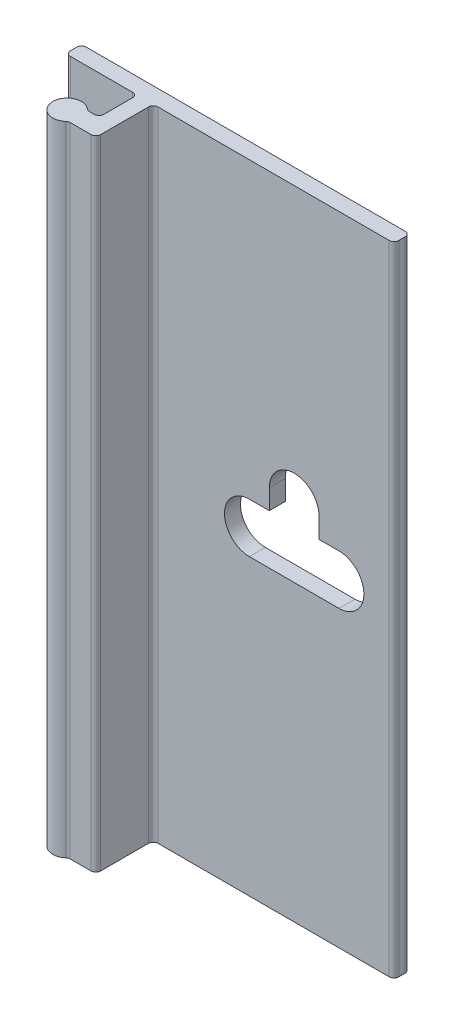
ISO-10303-21;
HEADER;
FILE_DESCRIPTION(('STEP AP214'),'2;1');
FILE_NAME('part.step','',(''),(''),'','','');
FILE_SCHEMA(('AUTOMOTIVE_DESIGN { 1 0 10303 214 1 1 1 1 }'));
ENDSEC;
DATA;
#1=APPLICATION_CONTEXT('core data for automotive mechanical design processes');
#2=APPLICATION_PROTOCOL_DEFINITION('international standard','automotive_design',2000,#1);
#3=PRODUCT_CONTEXT('',#1,'mechanical');
#4=PRODUCT('Part','Part','',(#3));
#5=PRODUCT_RELATED_PRODUCT_CATEGORY('part','',(#4));
#6=PRODUCT_DEFINITION_FORMATION('','',#4);
#7=PRODUCT_DEFINITION_CONTEXT('part definition',#1,'design');
#8=PRODUCT_DEFINITION('design','',#6,#7);
#9=PRODUCT_DEFINITION_SHAPE('','',#8);
#10=(LENGTH_UNIT() NAMED_UNIT(*) SI_UNIT(.MILLI.,.METRE.));
#11=(NAMED_UNIT(*) PLANE_ANGLE_UNIT() SI_UNIT($,.RADIAN.));
#12=(NAMED_UNIT(*) SI_UNIT($,.STERADIAN.) SOLID_ANGLE_UNIT());
#13=UNCERTAINTY_MEASURE_WITH_UNIT(LENGTH_MEASURE(1.E-05),#10,'distance_accuracy_value','');
#14=(GEOMETRIC_REPRESENTATION_CONTEXT(3) GLOBAL_UNCERTAINTY_ASSIGNED_CONTEXT((#13)) GLOBAL_UNIT_ASSIGNED_CONTEXT((#10,
#11,#12)) REPRESENTATION_CONTEXT('',''));
#15=CARTESIAN_POINT('',(0.,0.,0.));
#16=DIRECTION('',(0.,0.,1.));
#17=DIRECTION('',(1.,0.,0.));
#18=AXIS2_PLACEMENT_3D('',#15,#16,#17);
#19=CARTESIAN_POINT('',(-5.96900000000001,50.8,0.381));
#20=DIRECTION('',(0.,-1.,0.));
#21=DIRECTION('',(0.,0.,-1.));
#22=AXIS2_PLACEMENT_3D('',#19,#20,#21);
#23=CYLINDRICAL_SURFACE('',#22,0.381);
#24=CARTESIAN_POINT('',(-5.96900000000001,0.,0.381));
#25=DIRECTION('',(0.,1.,0.));
#26=DIRECTION('',(0.,0.,-1.));
#27=AXIS2_PLACEMENT_3D('',#24,#25,#26);
#28=CIRCLE('',#27,0.381);
#29=CARTESIAN_POINT('',(-5.96900000000001,0.,0.));
#30=VERTEX_POINT('',#29);
#31=CARTESIAN_POINT('',(-6.35000000000001,0.,0.381000000000002));
#32=VERTEX_POINT('',#31);
#33=EDGE_CURVE('E275',#30,#32,#28,.T.);
#34=ORIENTED_EDGE('',*,*,#33,.T.);
#35=DIRECTION('',(0.,-1.,0.));
#36=VECTOR('',#35,1.);
#37=CARTESIAN_POINT('',(-6.35000000000001,50.8,0.381000000000002));
#38=LINE('',#37,#36);
#39=CARTESIAN_POINT('',(-6.35000000000001,50.8,0.381000000000002));
#40=VERTEX_POINT('',#39);
#41=EDGE_CURVE('E417',#40,#32,#38,.T.);
#42=ORIENTED_EDGE('',*,*,#41,.F.);
#43=CARTESIAN_POINT('',(-5.96900000000001,50.8,0.381));
#44=DIRECTION('',(0.,1.,0.));
#45=DIRECTION('',(0.,0.,-1.));
#46=AXIS2_PLACEMENT_3D('',#43,#44,#45);
#47=CIRCLE('',#46,0.381);
#48=CARTESIAN_POINT('',(-5.96900000000001,50.8,0.));
#49=VERTEX_POINT('',#48);
#50=EDGE_CURVE('E287',#49,#40,#47,.T.);
#51=ORIENTED_EDGE('',*,*,#50,.F.);
#52=DIRECTION('',(0.,-1.,0.));
#53=VECTOR('',#52,1.);
#54=CARTESIAN_POINT('',(-5.96900000000001,50.8,0.));
#55=LINE('',#54,#53);
#56=EDGE_CURVE('E328',#49,#30,#55,.T.);
#57=ORIENTED_EDGE('',*,*,#56,.T.);
#58=EDGE_LOOP('',(#34,#42,#51,#57));
#59=FACE_BOUND('',#58,.T.);
#60=ADVANCED_FACE('F34',(#59),#23,.T.);
#61=CARTESIAN_POINT('',(-6.35000000000001,50.8,0.889000000000004));
#62=DIRECTION('',(1.,0.,0.));
#63=DIRECTION('',(0.,0.,-1.));
#64=AXIS2_PLACEMENT_3D('',#61,#62,#63);
#65=PLANE('',#64);
#66=DIRECTION('',(0.,0.,1.));
#67=VECTOR('',#66,1.);
#68=CARTESIAN_POINT('',(-6.35000000000001,0.,0.889000000000004));
#69=LINE('',#68,#67);
#70=CARTESIAN_POINT('',(-6.35000000000001,0.,0.889000000000004));
#71=VERTEX_POINT('',#70);
#72=EDGE_CURVE('E331',#32,#71,#69,.T.);
#73=ORIENTED_EDGE('',*,*,#72,.T.);
#74=DIRECTION('',(0.,-1.,0.));
#75=VECTOR('',#74,1.);
#76=CARTESIAN_POINT('',(-6.35000000000001,50.8,0.889000000000004));
#77=LINE('',#76,#75);
#78=CARTESIAN_POINT('',(-6.35000000000001,50.8,0.889000000000004));
#79=VERTEX_POINT('',#78);
#80=EDGE_CURVE('E414',#79,#71,#77,.T.);
#81=ORIENTED_EDGE('',*,*,#80,.F.);
#82=DIRECTION('',(0.,0.,1.));
#83=VECTOR('',#82,1.);
#84=CARTESIAN_POINT('',(-6.35000000000001,50.8,0.889000000000004));
#85=LINE('',#84,#83);
#86=EDGE_CURVE('E290',#40,#79,#85,.T.);
#87=ORIENTED_EDGE('',*,*,#86,.F.);
#88=ORIENTED_EDGE('',*,*,#41,.T.);
#89=EDGE_LOOP('',(#73,#81,#87,#88));
#90=FACE_BOUND('',#89,.T.);
#91=ADVANCED_FACE('F490',(#90),#65,.F.);
#92=CARTESIAN_POINT('',(-5.96900000000001,50.8,0.889000000000004));
#93=DIRECTION('',(0.,-1.,0.));
#94=DIRECTION('',(0.,0.,-1.));
#95=AXIS2_PLACEMENT_3D('',#92,#93,#94);
#96=CYLINDRICAL_SURFACE('',#95,0.381000000000001);
#97=CARTESIAN_POINT('',(-5.96900000000001,0.,0.889000000000004));
#98=DIRECTION('',(0.,1.,0.));
#99=DIRECTION('',(0.,0.,-1.));
#100=AXIS2_PLACEMENT_3D('',#97,#98,#99);
#101=CIRCLE('',#100,0.381000000000001);
#102=CARTESIAN_POINT('',(-5.96900000000001,0.,1.27000000000001));
#103=VERTEX_POINT('',#102);
#104=EDGE_CURVE('E333',#71,#103,#101,.T.);
#105=ORIENTED_EDGE('',*,*,#104,.T.);
#106=DIRECTION('',(0.,-1.,0.));
#107=VECTOR('',#106,1.);
#108=CARTESIAN_POINT('',(-5.96900000000001,50.8,1.27000000000001));
#109=LINE('',#108,#107);
#110=CARTESIAN_POINT('',(-5.96900000000001,50.8,1.27000000000001));
#111=VERTEX_POINT('',#110);
#112=EDGE_CURVE('E411',#111,#103,#109,.T.);
#113=ORIENTED_EDGE('',*,*,#112,.F.);
#114=CARTESIAN_POINT('',(-5.96900000000001,50.8,0.889000000000004));
#115=DIRECTION('',(0.,1.,0.));
#116=DIRECTION('',(0.,0.,-1.));
#117=AXIS2_PLACEMENT_3D('',#114,#115,#116);
#118=CIRCLE('',#117,0.381000000000001);
#119=EDGE_CURVE('E293',#79,#111,#118,.T.);
#120=ORIENTED_EDGE('',*,*,#119,.F.);
#121=ORIENTED_EDGE('',*,*,#80,.T.);
#122=EDGE_LOOP('',(#105,#113,#120,#121));
#123=FACE_BOUND('',#122,.T.);
#124=ADVANCED_FACE('F487',(#123),#96,.T.);
#125=CARTESIAN_POINT('',(-1.016,50.8,1.27));
#126=DIRECTION('',(0.,0.,-1.));
#127=DIRECTION('',(-1.,0.,0.));
#128=AXIS2_PLACEMENT_3D('',#125,#126,#127);
#129=PLANE('',#128);
#130=DIRECTION('',(1.,0.,0.));
#131=VECTOR('',#130,1.);
#132=CARTESIAN_POINT('',(-1.016,0.,1.27));
#133=LINE('',#132,#131);
#134=CARTESIAN_POINT('',(-1.016,0.,1.27));
#135=VERTEX_POINT('',#134);
#136=EDGE_CURVE('E335',#103,#135,#133,.T.);
#137=ORIENTED_EDGE('',*,*,#136,.T.);
#138=DIRECTION('',(0.,-1.,0.));
#139=VECTOR('',#138,1.);
#140=CARTESIAN_POINT('',(-1.016,50.8,1.27));
#141=LINE('',#140,#139);
#142=CARTESIAN_POINT('',(-1.016,50.8,1.27));
#143=VERTEX_POINT('',#142);
#144=EDGE_CURVE('E408',#143,#135,#141,.T.);
#145=ORIENTED_EDGE('',*,*,#144,.F.);
#146=DIRECTION('',(1.,0.,0.));
#147=VECTOR('',#146,1.);
#148=CARTESIAN_POINT('',(-1.016,50.8,1.27));
#149=LINE('',#148,#147);
#150=EDGE_CURVE('E295',#111,#143,#149,.T.);
#151=ORIENTED_EDGE('',*,*,#150,.F.);
#152=ORIENTED_EDGE('',*,*,#112,.T.);
#153=EDGE_LOOP('',(#137,#145,#151,#152));
#154=FACE_BOUND('',#153,.T.);
#155=ADVANCED_FACE('F482',(#154),#129,.F.);
#156=CARTESIAN_POINT('',(-1.016,50.8,1.651));
#157=DIRECTION('',(0.,-1.,0.));
#158=DIRECTION('',(0.,0.,-1.));
#159=AXIS2_PLACEMENT_3D('',#156,#157,#158);
#160=CYLINDRICAL_SURFACE('',#159,0.381);
#161=CARTESIAN_POINT('',(-1.016,0.,1.651));
#162=DIRECTION('',(0.,-1.,0.));
#163=DIRECTION('',(0.,0.,-1.));
#164=AXIS2_PLACEMENT_3D('',#161,#162,#163);
#165=CIRCLE('',#164,0.381);
#166=CARTESIAN_POINT('',(-0.634999999999999,0.,1.651));
#167=VERTEX_POINT('',#166);
#168=EDGE_CURVE('E337',#135,#167,#165,.T.);
#169=ORIENTED_EDGE('',*,*,#168,.T.);
#170=DIRECTION('',(0.,-1.,0.));
#171=VECTOR('',#170,1.);
#172=CARTESIAN_POINT('',(-0.634999999999999,50.8,1.651));
#173=LINE('',#172,#171);
#174=CARTESIAN_POINT('',(-0.634999999999999,50.8,1.651));
#175=VERTEX_POINT('',#174);
#176=EDGE_CURVE('E405',#175,#167,#173,.T.);
#177=ORIENTED_EDGE('',*,*,#176,.F.);
#178=CARTESIAN_POINT('',(-1.016,50.8,1.651));
#179=DIRECTION('',(0.,-1.,0.));
#180=DIRECTION('',(0.,0.,-1.));
#181=AXIS2_PLACEMENT_3D('',#178,#179,#180);
#182=CIRCLE('',#181,0.381);
#183=EDGE_CURVE('E297',#143,#175,#182,.T.);
#184=ORIENTED_EDGE('',*,*,#183,.F.);
#185=ORIENTED_EDGE('',*,*,#144,.T.);
#186=EDGE_LOOP('',(#169,#177,#184,#185));
#187=FACE_BOUND('',#186,.T.);
#188=ADVANCED_FACE('F477',(#187),#160,.F.);
#189=CARTESIAN_POINT('',(-0.634999999999999,50.8,1.651));
#190=DIRECTION('',(1.,0.,0.));
#191=DIRECTION('',(0.,0.,-1.));
#192=AXIS2_PLACEMENT_3D('',#189,#190,#191);
#193=PLANE('',#192);
#194=DIRECTION('',(0.,0.,1.));
#195=VECTOR('',#194,1.);
#196=CARTESIAN_POINT('',(-0.634999999999999,0.,1.651));
#197=LINE('',#196,#195);
#198=CARTESIAN_POINT('',(-0.634999999999999,0.,3.937));
#199=VERTEX_POINT('',#198);
#200=EDGE_CURVE('E339',#167,#199,#197,.T.);
#201=ORIENTED_EDGE('',*,*,#200,.T.);
#202=DIRECTION('',(0.,-1.,0.));
#203=VECTOR('',#202,1.);
#204=CARTESIAN_POINT('',(-0.634999999999999,50.8,3.937));
#205=LINE('',#204,#203);
#206=CARTESIAN_POINT('',(-0.634999999999999,50.8,3.937));
#207=VERTEX_POINT('',#206);
#208=EDGE_CURVE('E402',#207,#199,#205,.T.);
#209=ORIENTED_EDGE('',*,*,#208,.F.);
#210=DIRECTION('',(0.,0.,1.));
#211=VECTOR('',#210,1.);
#212=CARTESIAN_POINT('',(-0.634999999999999,50.8,1.651));
#213=LINE('',#212,#211);
#214=EDGE_CURVE('E299',#175,#207,#213,.T.);
#215=ORIENTED_EDGE('',*,*,#214,.F.);
#216=ORIENTED_EDGE('',*,*,#176,.T.);
#217=EDGE_LOOP('',(#201,#209,#215,#216));
#218=FACE_BOUND('',#217,.T.);
#219=ADVANCED_FACE('F473',(#218),#193,.F.);
#220=CARTESIAN_POINT('',(-1.016,50.8,3.937));
#221=DIRECTION('',(0.,-1.,0.));
#222=DIRECTION('',(0.,0.,-1.));
#223=AXIS2_PLACEMENT_3D('',#220,#221,#222);
#224=CYLINDRICAL_SURFACE('',#223,0.381);
#225=CARTESIAN_POINT('',(-1.016,0.,3.937));
#226=DIRECTION('',(0.,-1.,0.));
#227=DIRECTION('',(0.,0.,-1.));
#228=AXIS2_PLACEMENT_3D('',#225,#226,#227);
#229=CIRCLE('',#228,0.381);
#230=CARTESIAN_POINT('',(-1.016,0.,4.318));
#231=VERTEX_POINT('',#230);
#232=EDGE_CURVE('E341',#199,#231,#229,.T.);
#233=ORIENTED_EDGE('',*,*,#232,.T.);
#234=DIRECTION('',(0.,-1.,0.));
#235=VECTOR('',#234,1.);
#236=CARTESIAN_POINT('',(-1.016,50.8,4.318));
#237=LINE('',#236,#235);
#238=CARTESIAN_POINT('',(-1.016,50.8,4.318));
#239=VERTEX_POINT('',#238);
#240=EDGE_CURVE('E399',#239,#231,#237,.T.);
#241=ORIENTED_EDGE('',*,*,#240,.F.);
#242=CARTESIAN_POINT('',(-1.016,50.8,3.937));
#243=DIRECTION('',(0.,-1.,0.));
#244=DIRECTION('',(0.,0.,-1.));
#245=AXIS2_PLACEMENT_3D('',#242,#243,#244);
#246=CIRCLE('',#245,0.381);
#247=EDGE_CURVE('E301',#207,#239,#246,.T.);
#248=ORIENTED_EDGE('',*,*,#247,.F.);
#249=ORIENTED_EDGE('',*,*,#208,.T.);
#250=EDGE_LOOP('',(#233,#241,#248,#249));
#251=FACE_BOUND('',#250,.T.);
#252=ADVANCED_FACE('F468',(#251),#224,.F.);
#253=CARTESIAN_POINT('',(-1.40496875048439,50.8,4.318));
#254=DIRECTION('',(0.,0.,1.));
#255=DIRECTION('',(1.,0.,0.));
#256=AXIS2_PLACEMENT_3D('',#253,#254,#255);
#257=PLANE('',#256);
#258=DIRECTION('',(-1.,0.,0.));
#259=VECTOR('',#258,1.);
#260=CARTESIAN_POINT('',(-1.40496875048439,0.,4.318));
#261=LINE('',#260,#259);
#262=CARTESIAN_POINT('',(-1.40496875048439,0.,4.318));
#263=VERTEX_POINT('',#262);
#264=EDGE_CURVE('E343',#231,#263,#261,.T.);
#265=ORIENTED_EDGE('',*,*,#264,.T.);
#266=DIRECTION('',(0.,-1.,0.));
#267=VECTOR('',#266,1.);
#268=CARTESIAN_POINT('',(-1.40496875048439,50.8,4.318));
#269=LINE('',#268,#267);
#270=CARTESIAN_POINT('',(-1.40496875048439,50.8,4.318));
#271=VERTEX_POINT('',#270);
#272=EDGE_CURVE('E396',#271,#263,#269,.T.);
#273=ORIENTED_EDGE('',*,*,#272,.F.);
#274=DIRECTION('',(-1.,0.,0.));
#275=VECTOR('',#274,1.);
#276=CARTESIAN_POINT('',(-1.40496875048439,50.8,4.318));
#277=LINE('',#276,#275);
#278=EDGE_CURVE('E303',#239,#271,#277,.T.);
#279=ORIENTED_EDGE('',*,*,#278,.F.);
#280=ORIENTED_EDGE('',*,*,#240,.T.);
#281=EDGE_LOOP('',(#265,#273,#279,#280));
#282=FACE_BOUND('',#281,.T.);
#283=ADVANCED_FACE('F462',(#282),#257,.F.);
#284=CARTESIAN_POINT('',(-1.40496875048439,50.8,3.937));
#285=DIRECTION('',(0.,-1.,0.));
#286=DIRECTION('',(0.,0.,-1.));
#287=AXIS2_PLACEMENT_3D('',#284,#285,#286);
#288=CYLINDRICAL_SURFACE('',#287,0.381);
#289=CARTESIAN_POINT('',(-1.40496875048439,0.,3.937));
#290=DIRECTION('',(0.,-1.,0.));
#291=DIRECTION('',(0.,0.,-1.));
#292=AXIS2_PLACEMENT_3D('',#289,#290,#291);
#293=CIRCLE('',#292,0.381);
#294=CARTESIAN_POINT('',(-1.65697656286329,0.,4.22275));
#295=VERTEX_POINT('',#294);
#296=EDGE_CURVE('E345',#263,#295,#293,.T.);
#297=ORIENTED_EDGE('',*,*,#296,.T.);
#298=DIRECTION('',(0.,-1.,0.));
#299=VECTOR('',#298,1.);
#300=CARTESIAN_POINT('',(-1.65697656286329,50.8,4.22275));
#301=LINE('',#300,#299);
#302=CARTESIAN_POINT('',(-1.65697656286329,50.8,4.22275));
#303=VERTEX_POINT('',#302);
#304=EDGE_CURVE('E393',#303,#295,#301,.T.);
#305=ORIENTED_EDGE('',*,*,#304,.F.);
#306=CARTESIAN_POINT('',(-1.40496875048439,50.8,3.937));
#307=DIRECTION('',(0.,-1.,0.));
#308=DIRECTION('',(0.,0.,-1.));
#309=AXIS2_PLACEMENT_3D('',#306,#307,#308);
#310=CIRCLE('',#309,0.381);
#311=EDGE_CURVE('E305',#271,#303,#310,.T.);
#312=ORIENTED_EDGE('',*,*,#311,.F.);
#313=ORIENTED_EDGE('',*,*,#272,.T.);
#314=EDGE_LOOP('',(#297,#305,#312,#313));
#315=FACE_BOUND('',#314,.T.);
#316=ADVANCED_FACE('F458',(#315),#288,.F.);
#317=CARTESIAN_POINT('',(-2.413,50.8,5.08));
#318=DIRECTION('',(0.,-1.,0.));
#319=DIRECTION('',(0.,0.,-1.));
#320=AXIS2_PLACEMENT_3D('',#317,#318,#319);
#321=CYLINDRICAL_SURFACE('',#320,1.143);
#322=CARTESIAN_POINT('',(-2.413,0.,5.08));
#323=DIRECTION('',(0.,1.,0.));
#324=DIRECTION('',(0.,0.,1.));
#325=AXIS2_PLACEMENT_3D('',#322,#323,#324);
#326=CIRCLE('',#325,1.143);
#327=CARTESIAN_POINT('',(-1.65697656286329,0.,5.93725));
#328=VERTEX_POINT('',#327);
#329=EDGE_CURVE('E347',#295,#328,#326,.T.);
#330=ORIENTED_EDGE('',*,*,#329,.T.);
#331=DIRECTION('',(0.,-1.,0.));
#332=VECTOR('',#331,1.);
#333=CARTESIAN_POINT('',(-1.65697656286329,50.8,5.93725));
#334=LINE('',#333,#332);
#335=CARTESIAN_POINT('',(-1.65697656286329,50.8,5.93725));
#336=VERTEX_POINT('',#335);
#337=EDGE_CURVE('E390',#336,#328,#334,.T.);
#338=ORIENTED_EDGE('',*,*,#337,.F.);
#339=CARTESIAN_POINT('',(-2.413,50.8,5.08));
#340=DIRECTION('',(0.,1.,0.));
#341=DIRECTION('',(0.,0.,1.));
#342=AXIS2_PLACEMENT_3D('',#339,#340,#341);
#343=CIRCLE('',#342,1.143);
#344=EDGE_CURVE('E307',#303,#336,#343,.T.);
#345=ORIENTED_EDGE('',*,*,#344,.F.);
#346=ORIENTED_EDGE('',*,*,#304,.T.);
#347=EDGE_LOOP('',(#330,#338,#345,#346));
#348=FACE_BOUND('',#347,.T.);
#349=ADVANCED_FACE('F454',(#348),#321,.T.);
#350=CARTESIAN_POINT('',(-1.40496875048439,50.8,6.223));
#351=DIRECTION('',(0.,-1.,0.));
#352=DIRECTION('',(0.,0.,-1.));
#353=AXIS2_PLACEMENT_3D('',#350,#351,#352);
#354=CYLINDRICAL_SURFACE('',#353,0.381);
#355=CARTESIAN_POINT('',(-1.40496875048439,0.,6.223));
#356=DIRECTION('',(0.,-1.,0.));
#357=DIRECTION('',(0.,0.,1.));
#358=AXIS2_PLACEMENT_3D('',#355,#356,#357);
#359=CIRCLE('',#358,0.381);
#360=CARTESIAN_POINT('',(-1.40496875048439,0.,5.842));
#361=VERTEX_POINT('',#360);
#362=EDGE_CURVE('E349',#328,#361,#359,.T.);
#363=ORIENTED_EDGE('',*,*,#362,.T.);
#364=DIRECTION('',(0.,-1.,0.));
#365=VECTOR('',#364,1.);
#366=CARTESIAN_POINT('',(-1.40496875048439,50.8,5.842));
#367=LINE('',#366,#365);
#368=CARTESIAN_POINT('',(-1.40496875048439,50.8,5.842));
#369=VERTEX_POINT('',#368);
#370=EDGE_CURVE('E387',#369,#361,#367,.T.);
#371=ORIENTED_EDGE('',*,*,#370,.F.);
#372=CARTESIAN_POINT('',(-1.40496875048439,50.8,6.223));
#373=DIRECTION('',(0.,-1.,0.));
#374=DIRECTION('',(0.,0.,1.));
#375=AXIS2_PLACEMENT_3D('',#372,#373,#374);
#376=CIRCLE('',#375,0.381);
#377=EDGE_CURVE('E309',#336,#369,#376,.T.);
#378=ORIENTED_EDGE('',*,*,#377,.F.);
#379=ORIENTED_EDGE('',*,*,#337,.T.);
#380=EDGE_LOOP('',(#363,#371,#378,#379));
#381=FACE_BOUND('',#380,.T.);
#382=ADVANCED_FACE('F448',(#381),#354,.F.);
#383=CARTESIAN_POINT('',(-1.40496875048439,50.8,5.842));
#384=DIRECTION('',(0.,0.,-1.));
#385=DIRECTION('',(-1.,0.,0.));
#386=AXIS2_PLACEMENT_3D('',#383,#384,#385);
#387=PLANE('',#386);
#388=DIRECTION('',(1.,0.,0.));
#389=VECTOR('',#388,1.);
#390=CARTESIAN_POINT('',(-1.40496875048439,0.,5.842));
#391=LINE('',#390,#389);
#392=CARTESIAN_POINT('',(0.254000000000001,0.,5.842));
#393=VERTEX_POINT('',#392);
#394=EDGE_CURVE('E351',#361,#393,#391,.T.);
#395=ORIENTED_EDGE('',*,*,#394,.T.);
#396=DIRECTION('',(0.,1.,0.));
#397=VECTOR('',#396,1.);
#398=CARTESIAN_POINT('',(0.254000000000001,50.8,5.842));
#399=LINE('',#398,#397);
#400=CARTESIAN_POINT('',(0.254000000000001,50.8,5.842));
#401=VERTEX_POINT('',#400);
#402=EDGE_CURVE('E420',#393,#401,#399,.T.);
#403=ORIENTED_EDGE('',*,*,#402,.T.);
#404=DIRECTION('',(1.,0.,0.));
#405=VECTOR('',#404,1.);
#406=CARTESIAN_POINT('',(-1.40496875048439,50.8,5.842));
#407=LINE('',#406,#405);
#408=EDGE_CURVE('E311',#369,#401,#407,.T.);
#409=ORIENTED_EDGE('',*,*,#408,.F.);
#410=ORIENTED_EDGE('',*,*,#370,.T.);
#411=EDGE_LOOP('',(#395,#403,#409,#410));
#412=FACE_BOUND('',#411,.T.);
#413=ADVANCED_FACE('F440',(#412),#387,.F.);
#414=CARTESIAN_POINT('',(0.635000000000001,50.8,1.651));
#415=DIRECTION('',(-1.,0.,0.));
#416=DIRECTION('',(0.,0.,1.));
#417=AXIS2_PLACEMENT_3D('',#414,#415,#416);
#418=PLANE('',#417);
#419=DIRECTION('',(0.,0.,-1.));
#420=VECTOR('',#419,1.);
#421=CARTESIAN_POINT('',(0.635000000000001,50.8,1.651));
#422=LINE('',#421,#420);
#423=CARTESIAN_POINT('',(0.635000000000001,50.8,5.461));
#424=VERTEX_POINT('',#423);
#425=CARTESIAN_POINT('',(0.635000000000001,50.8,1.651));
#426=VERTEX_POINT('',#425);
#427=EDGE_CURVE('E314',#424,#426,#422,.T.);
#428=ORIENTED_EDGE('',*,*,#427,.F.);
#429=DIRECTION('',(0.,1.,0.));
#430=VECTOR('',#429,1.);
#431=CARTESIAN_POINT('',(0.635000000000001,50.8,5.461));
#432=LINE('',#431,#430);
#433=CARTESIAN_POINT('',(0.635000000000001,0.,5.461));
#434=VERTEX_POINT('',#433);
#435=EDGE_CURVE('E42',#424,#434,#432,.F.);
#436=ORIENTED_EDGE('',*,*,#435,.T.);
#437=DIRECTION('',(0.,0.,-1.));
#438=VECTOR('',#437,1.);
#439=CARTESIAN_POINT('',(0.635000000000001,0.,1.651));
#440=LINE('',#439,#438);
#441=CARTESIAN_POINT('',(0.635000000000001,0.,1.651));
#442=VERTEX_POINT('',#441);
#443=EDGE_CURVE('E354',#434,#442,#440,.T.);
#444=ORIENTED_EDGE('',*,*,#443,.T.);
#445=DIRECTION('',(0.,-1.,0.));
#446=VECTOR('',#445,1.);
#447=CARTESIAN_POINT('',(0.635000000000001,50.8,1.651));
#448=LINE('',#447,#446);
#449=EDGE_CURVE('E384',#426,#442,#448,.T.);
#450=ORIENTED_EDGE('',*,*,#449,.F.);
#451=EDGE_LOOP('',(#428,#436,#444,#450));
#452=FACE_BOUND('',#451,.T.);
#453=ADVANCED_FACE('F428',(#452),#418,.F.);
#454=CARTESIAN_POINT('',(1.016,50.8,1.651));
#455=DIRECTION('',(0.,-1.,0.));
#456=DIRECTION('',(0.,0.,-1.));
#457=AXIS2_PLACEMENT_3D('',#454,#455,#456);
#458=CYLINDRICAL_SURFACE('',#457,0.381000000000001);
#459=CARTESIAN_POINT('',(1.016,0.,1.651));
#460=DIRECTION('',(0.,-1.,0.));
#461=DIRECTION('',(0.,0.,1.));
#462=AXIS2_PLACEMENT_3D('',#459,#460,#461);
#463=CIRCLE('',#462,0.381000000000001);
#464=CARTESIAN_POINT('',(1.016,0.,1.27));
#465=VERTEX_POINT('',#464);
#466=EDGE_CURVE('E356',#442,#465,#463,.T.);
#467=ORIENTED_EDGE('',*,*,#466,.T.);
#468=DIRECTION('',(0.,-1.,0.));
#469=VECTOR('',#468,1.);
#470=CARTESIAN_POINT('',(1.016,50.8,1.27));
#471=LINE('',#470,#469);
#472=CARTESIAN_POINT('',(1.016,50.8,1.27));
#473=VERTEX_POINT('',#472);
#474=EDGE_CURVE('E381',#473,#465,#471,.T.);
#475=ORIENTED_EDGE('',*,*,#474,.F.);
#476=CARTESIAN_POINT('',(1.016,50.8,1.651));
#477=DIRECTION('',(0.,-1.,0.));
#478=DIRECTION('',(0.,0.,1.));
#479=AXIS2_PLACEMENT_3D('',#476,#477,#478);
#480=CIRCLE('',#479,0.381000000000001);
#481=EDGE_CURVE('E316',#426,#473,#480,.T.);
#482=ORIENTED_EDGE('',*,*,#481,.F.);
#483=ORIENTED_EDGE('',*,*,#449,.T.);
#484=EDGE_LOOP('',(#467,#475,#482,#483));
#485=FACE_BOUND('',#484,.T.);
#486=ADVANCED_FACE('F520',(#485),#458,.F.);
#487=CARTESIAN_POINT('',(19.431,50.8,1.27));
#488=DIRECTION('',(0.,0.,-1.));
#489=DIRECTION('',(-1.,0.,0.));
#490=AXIS2_PLACEMENT_3D('',#487,#488,#489);
#491=PLANE('',#490);
#492=DIRECTION('',(1.,0.,0.));
#493=VECTOR('',#492,1.);
#494=CARTESIAN_POINT('',(8.2931,23.4188,1.27));
#495=LINE('',#494,#493);
#496=CARTESIAN_POINT('',(8.2931,23.4188,1.27));
#497=VERTEX_POINT('',#496);
#498=CARTESIAN_POINT('',(15.4305,23.4188,1.27));
#499=VERTEX_POINT('',#498);
#500=EDGE_CURVE('E257',#497,#499,#495,.T.);
#501=ORIENTED_EDGE('',*,*,#500,.F.);
#502=CARTESIAN_POINT('',(8.2931,25.4,1.27));
#503=DIRECTION('',(0.,0.,1.));
#504=DIRECTION('',(1.,0.,0.));
#505=AXIS2_PLACEMENT_3D('',#502,#503,#504);
#506=CIRCLE('',#505,1.9812);
#507=CARTESIAN_POINT('',(8.2931,27.3812,1.27));
#508=VERTEX_POINT('',#507);
#509=EDGE_CURVE('E49',#508,#497,#506,.T.);
#510=ORIENTED_EDGE('',*,*,#509,.F.);
#511=DIRECTION('',(-1.,0.,0.));
#512=VECTOR('',#511,1.);
#513=CARTESIAN_POINT('',(8.2931,27.3812,1.27));
#514=LINE('',#513,#512);
#515=CARTESIAN_POINT('',(9.8806,27.3812,1.27));
#516=VERTEX_POINT('',#515);
#517=EDGE_CURVE('E237',#516,#508,#514,.T.);
#518=ORIENTED_EDGE('',*,*,#517,.F.);
#519=DIRECTION('',(0.,-1.,0.));
#520=VECTOR('',#519,1.);
#521=CARTESIAN_POINT('',(9.8806,28.9814000000001,1.27));
#522=LINE('',#521,#520);
#523=CARTESIAN_POINT('',(9.8806,28.9814000000001,1.27));
#524=VERTEX_POINT('',#523);
#525=EDGE_CURVE('E240',#524,#516,#522,.T.);
#526=ORIENTED_EDGE('',*,*,#525,.F.);
#527=CARTESIAN_POINT('',(11.8618,28.9814000000001,1.27));
#528=DIRECTION('',(0.,0.,1.));
#529=DIRECTION('',(1.,0.,0.));
#530=AXIS2_PLACEMENT_3D('',#527,#528,#529);
#531=CIRCLE('',#530,1.9812);
#532=CARTESIAN_POINT('',(13.843,28.9814000000001,1.27));
#533=VERTEX_POINT('',#532);
#534=EDGE_CURVE('E268',#533,#524,#531,.T.);
#535=ORIENTED_EDGE('',*,*,#534,.F.);
#536=DIRECTION('',(0.,1.,0.));
#537=VECTOR('',#536,1.);
#538=CARTESIAN_POINT('',(13.843,28.9814000000001,1.27));
#539=LINE('',#538,#537);
#540=CARTESIAN_POINT('',(13.843,27.3812,1.27));
#541=VERTEX_POINT('',#540);
#542=EDGE_CURVE('E265',#541,#533,#539,.T.);
#543=ORIENTED_EDGE('',*,*,#542,.F.);
#544=DIRECTION('',(-1.,0.,0.));
#545=VECTOR('',#544,1.);
#546=CARTESIAN_POINT('',(13.843,27.3812,1.27));
#547=LINE('',#546,#545);
#548=CARTESIAN_POINT('',(15.4305,27.3812,1.27));
#549=VERTEX_POINT('',#548);
#550=EDGE_CURVE('E262',#549,#541,#547,.T.);
#551=ORIENTED_EDGE('',*,*,#550,.F.);
#552=CARTESIAN_POINT('',(15.4305,25.4,1.27));
#553=DIRECTION('',(0.,0.,1.));
#554=DIRECTION('',(1.,0.,0.));
#555=AXIS2_PLACEMENT_3D('',#552,#553,#554);
#556=CIRCLE('',#555,1.9812);
#557=EDGE_CURVE('E259',#499,#549,#556,.T.);
#558=ORIENTED_EDGE('',*,*,#557,.F.);
#559=EDGE_LOOP('',(#501,#510,#518,#526,#535,#543,#551,#558));
#560=FACE_BOUND('',#559,.T.);
#561=DIRECTION('',(1.,0.,0.));
#562=VECTOR('',#561,1.);
#563=CARTESIAN_POINT('',(19.431,0.,1.27));
#564=LINE('',#563,#562);
#565=CARTESIAN_POINT('',(19.431,0.,1.27));
#566=VERTEX_POINT('',#565);
#567=EDGE_CURVE('E358',#465,#566,#564,.T.);
#568=ORIENTED_EDGE('',*,*,#567,.T.);
#569=DIRECTION('',(0.,-1.,0.));
#570=VECTOR('',#569,1.);
#571=CARTESIAN_POINT('',(19.431,50.8,1.27));
#572=LINE('',#571,#570);
#573=CARTESIAN_POINT('',(19.431,50.8,1.27));
#574=VERTEX_POINT('',#573);
#575=EDGE_CURVE('E378',#574,#566,#572,.T.);
#576=ORIENTED_EDGE('',*,*,#575,.F.);
#577=DIRECTION('',(1.,0.,0.));
#578=VECTOR('',#577,1.);
#579=CARTESIAN_POINT('',(19.431,50.8,1.27));
#580=LINE('',#579,#578);
#581=EDGE_CURVE('E318',#473,#574,#580,.T.);
#582=ORIENTED_EDGE('',*,*,#581,.F.);
#583=ORIENTED_EDGE('',*,*,#474,.T.);
#584=EDGE_LOOP('',(#568,#576,#582,#583));
#585=FACE_BOUND('',#584,.T.);
#586=ADVANCED_FACE('F516',(#560,#585),#491,.F.);
#587=CARTESIAN_POINT('',(19.431,50.8,0.889));
#588=DIRECTION('',(0.,-1.,0.));
#589=DIRECTION('',(0.,0.,-1.));
#590=AXIS2_PLACEMENT_3D('',#587,#588,#589);
#591=CYLINDRICAL_SURFACE('',#590,0.381000000000002);
#592=CARTESIAN_POINT('',(19.431,0.,0.889));
#593=DIRECTION('',(0.,1.,0.));
#594=DIRECTION('',(0.,0.,-1.));
#595=AXIS2_PLACEMENT_3D('',#592,#593,#594);
#596=CIRCLE('',#595,0.381000000000002);
#597=CARTESIAN_POINT('',(19.812,0.,0.889));
#598=VERTEX_POINT('',#597);
#599=EDGE_CURVE('E360',#566,#598,#596,.T.);
#600=ORIENTED_EDGE('',*,*,#599,.T.);
#601=DIRECTION('',(0.,-1.,0.));
#602=VECTOR('',#601,1.);
#603=CARTESIAN_POINT('',(19.812,50.8,0.889));
#604=LINE('',#603,#602);
#605=CARTESIAN_POINT('',(19.812,50.8,0.889));
#606=VERTEX_POINT('',#605);
#607=EDGE_CURVE('E375',#606,#598,#604,.T.);
#608=ORIENTED_EDGE('',*,*,#607,.F.);
#609=CARTESIAN_POINT('',(19.431,50.8,0.889));
#610=DIRECTION('',(0.,1.,0.));
#611=DIRECTION('',(0.,0.,-1.));
#612=AXIS2_PLACEMENT_3D('',#609,#610,#611);
#613=CIRCLE('',#612,0.381000000000002);
#614=EDGE_CURVE('E320',#574,#606,#613,.T.);
#615=ORIENTED_EDGE('',*,*,#614,.F.);
#616=ORIENTED_EDGE('',*,*,#575,.T.);
#617=EDGE_LOOP('',(#600,#608,#615,#616));
#618=FACE_BOUND('',#617,.T.);
#619=ADVANCED_FACE('F512',(#618),#591,.T.);
#620=CARTESIAN_POINT('',(19.812,50.8,0.381));
#621=DIRECTION('',(-1.,0.,0.));
#622=DIRECTION('',(0.,0.,1.));
#623=AXIS2_PLACEMENT_3D('',#620,#621,#622);
#624=PLANE('',#623);
#625=DIRECTION('',(0.,0.,-1.));
#626=VECTOR('',#625,1.);
#627=CARTESIAN_POINT('',(19.812,0.,0.381));
#628=LINE('',#627,#626);
#629=CARTESIAN_POINT('',(19.812,0.,0.381));
#630=VERTEX_POINT('',#629);
#631=EDGE_CURVE('E362',#598,#630,#628,.T.);
#632=ORIENTED_EDGE('',*,*,#631,.T.);
#633=DIRECTION('',(0.,-1.,0.));
#634=VECTOR('',#633,1.);
#635=CARTESIAN_POINT('',(19.812,50.8,0.381));
#636=LINE('',#635,#634);
#637=CARTESIAN_POINT('',(19.812,50.8,0.381));
#638=VERTEX_POINT('',#637);
#639=EDGE_CURVE('E372',#638,#630,#636,.T.);
#640=ORIENTED_EDGE('',*,*,#639,.F.);
#641=DIRECTION('',(0.,0.,-1.));
#642=VECTOR('',#641,1.);
#643=CARTESIAN_POINT('',(19.812,50.8,0.381));
#644=LINE('',#643,#642);
#645=EDGE_CURVE('E322',#606,#638,#644,.T.);
#646=ORIENTED_EDGE('',*,*,#645,.F.);
#647=ORIENTED_EDGE('',*,*,#607,.T.);
#648=EDGE_LOOP('',(#632,#640,#646,#647));
#649=FACE_BOUND('',#648,.T.);
#650=ADVANCED_FACE('F507',(#649),#624,.F.);
#651=CARTESIAN_POINT('',(19.431,50.8,0.381));
#652=DIRECTION('',(0.,-1.,0.));
#653=DIRECTION('',(0.,0.,-1.));
#654=AXIS2_PLACEMENT_3D('',#651,#652,#653);
#655=CYLINDRICAL_SURFACE('',#654,0.381000000000002);
#656=CARTESIAN_POINT('',(19.431,0.,0.381));
#657=DIRECTION('',(0.,1.,0.));
#658=DIRECTION('',(0.,0.,-1.));
#659=AXIS2_PLACEMENT_3D('',#656,#657,#658);
#660=CIRCLE('',#659,0.381000000000002);
#661=CARTESIAN_POINT('',(19.431,0.,0.));
#662=VERTEX_POINT('',#661);
#663=EDGE_CURVE('E364',#630,#662,#660,.T.);
#664=ORIENTED_EDGE('',*,*,#663,.T.);
#665=DIRECTION('',(0.,-1.,0.));
#666=VECTOR('',#665,1.);
#667=CARTESIAN_POINT('',(19.431,50.8,0.));
#668=LINE('',#667,#666);
#669=CARTESIAN_POINT('',(19.431,50.8,0.));
#670=VERTEX_POINT('',#669);
#671=EDGE_CURVE('E369',#670,#662,#668,.T.);
#672=ORIENTED_EDGE('',*,*,#671,.F.);
#673=CARTESIAN_POINT('',(19.431,50.8,0.381));
#674=DIRECTION('',(0.,1.,0.));
#675=DIRECTION('',(0.,0.,-1.));
#676=AXIS2_PLACEMENT_3D('',#673,#674,#675);
#677=CIRCLE('',#676,0.381000000000002);
#678=EDGE_CURVE('E324',#638,#670,#677,.T.);
#679=ORIENTED_EDGE('',*,*,#678,.F.);
#680=ORIENTED_EDGE('',*,*,#639,.T.);
#681=EDGE_LOOP('',(#664,#672,#679,#680));
#682=FACE_BOUND('',#681,.T.);
#683=ADVANCED_FACE('F502',(#682),#655,.T.);
#684=CARTESIAN_POINT('',(-5.96900000000001,50.8,0.));
#685=DIRECTION('',(0.,0.,1.));
#686=DIRECTION('',(1.,0.,0.));
#687=AXIS2_PLACEMENT_3D('',#684,#685,#686);
#688=PLANE('',#687);
#689=DIRECTION('',(-1.,0.,0.));
#690=VECTOR('',#689,1.);
#691=CARTESIAN_POINT('',(8.2931,27.3812,0.));
#692=LINE('',#691,#690);
#693=CARTESIAN_POINT('',(9.8806,27.3812,0.));
#694=VERTEX_POINT('',#693);
#695=CARTESIAN_POINT('',(8.2931,27.3812,0.));
#696=VERTEX_POINT('',#695);
#697=EDGE_CURVE('E226',#694,#696,#692,.T.);
#698=ORIENTED_EDGE('',*,*,#697,.T.);
#699=CARTESIAN_POINT('',(8.2931,25.4,0.));
#700=DIRECTION('',(0.,0.,1.));
#701=DIRECTION('',(1.,0.,0.));
#702=AXIS2_PLACEMENT_3D('',#699,#700,#701);
#703=CIRCLE('',#702,1.9812);
#704=CARTESIAN_POINT('',(8.2931,23.4188,0.));
#705=VERTEX_POINT('',#704);
#706=EDGE_CURVE('E220',#696,#705,#703,.T.);
#707=ORIENTED_EDGE('',*,*,#706,.T.);
#708=DIRECTION('',(1.,0.,0.));
#709=VECTOR('',#708,1.);
#710=CARTESIAN_POINT('',(8.2931,23.4188,0.));
#711=LINE('',#710,#709);
#712=CARTESIAN_POINT('',(15.4305,23.4188,0.));
#713=VERTEX_POINT('',#712);
#714=EDGE_CURVE('E229',#705,#713,#711,.T.);
#715=ORIENTED_EDGE('',*,*,#714,.T.);
#716=CARTESIAN_POINT('',(15.4305,25.4,0.));
#717=DIRECTION('',(0.,0.,1.));
#718=DIRECTION('',(1.,0.,0.));
#719=AXIS2_PLACEMENT_3D('',#716,#717,#718);
#720=CIRCLE('',#719,1.9812);
#721=CARTESIAN_POINT('',(15.4305,27.3812,0.));
#722=VERTEX_POINT('',#721);
#723=EDGE_CURVE('E57',#713,#722,#720,.T.);
#724=ORIENTED_EDGE('',*,*,#723,.T.);
#725=DIRECTION('',(-1.,0.,0.));
#726=VECTOR('',#725,1.);
#727=CARTESIAN_POINT('',(13.843,27.3812,0.));
#728=LINE('',#727,#726);
#729=CARTESIAN_POINT('',(13.843,27.3812,0.));
#730=VERTEX_POINT('',#729);
#731=EDGE_CURVE('E244',#722,#730,#728,.T.);
#732=ORIENTED_EDGE('',*,*,#731,.T.);
#733=DIRECTION('',(0.,1.,0.));
#734=VECTOR('',#733,1.);
#735=CARTESIAN_POINT('',(13.843,28.9814000000001,0.));
#736=LINE('',#735,#734);
#737=CARTESIAN_POINT('',(13.843,28.9814000000001,0.));
#738=VERTEX_POINT('',#737);
#739=EDGE_CURVE('E247',#730,#738,#736,.T.);
#740=ORIENTED_EDGE('',*,*,#739,.T.);
#741=CARTESIAN_POINT('',(11.8618,28.9814000000001,0.));
#742=DIRECTION('',(0.,0.,1.));
#743=DIRECTION('',(1.,0.,0.));
#744=AXIS2_PLACEMENT_3D('',#741,#742,#743);
#745=CIRCLE('',#744,1.9812);
#746=CARTESIAN_POINT('',(9.8806,28.9814000000001,0.));
#747=VERTEX_POINT('',#746);
#748=EDGE_CURVE('E250',#738,#747,#745,.T.);
#749=ORIENTED_EDGE('',*,*,#748,.T.);
#750=DIRECTION('',(0.,-1.,0.));
#751=VECTOR('',#750,1.);
#752=CARTESIAN_POINT('',(9.8806,28.9814000000001,0.));
#753=LINE('',#752,#751);
#754=EDGE_CURVE('E253',#747,#694,#753,.T.);
#755=ORIENTED_EDGE('',*,*,#754,.T.);
#756=EDGE_LOOP('',(#698,#707,#715,#724,#732,#740,#749,#755));
#757=FACE_BOUND('',#756,.T.);
#758=DIRECTION('',(-1.,0.,0.));
#759=VECTOR('',#758,1.);
#760=CARTESIAN_POINT('',(-5.96900000000001,0.,0.));
#761=LINE('',#760,#759);
#762=EDGE_CURVE('E291',#662,#30,#761,.T.);
#763=ORIENTED_EDGE('',*,*,#762,.T.);
#764=ORIENTED_EDGE('',*,*,#56,.F.);
#765=DIRECTION('',(-1.,0.,0.));
#766=VECTOR('',#765,1.);
#767=CARTESIAN_POINT('',(-5.96900000000001,50.8,0.));
#768=LINE('',#767,#766);
#769=EDGE_CURVE('E326',#670,#49,#768,.T.);
#770=ORIENTED_EDGE('',*,*,#769,.F.);
#771=ORIENTED_EDGE('',*,*,#671,.T.);
#772=EDGE_LOOP('',(#763,#764,#770,#771));
#773=FACE_BOUND('',#772,.T.);
#774=ADVANCED_FACE('F233',(#757,#773),#688,.F.);
#775=CARTESIAN_POINT('',(-5.96900000000001,50.8,0.381));
#776=DIRECTION('',(0.,-1.,0.));
#777=DIRECTION('',(0.,0.,-1.));
#778=AXIS2_PLACEMENT_3D('',#775,#776,#777);
#779=PLANE('',#778);
#780=ORIENTED_EDGE('',*,*,#408,.T.);
#781=CARTESIAN_POINT('',(0.254000000000001,50.8,5.461));
#782=DIRECTION('',(0.,-1.,0.));
#783=DIRECTION('',(0.,0.,-1.));
#784=AXIS2_PLACEMENT_3D('',#781,#782,#783);
#785=CIRCLE('',#784,0.381);
#786=EDGE_CURVE('E423',#401,#424,#785,.F.);
#787=ORIENTED_EDGE('',*,*,#786,.T.);
#788=ORIENTED_EDGE('',*,*,#427,.T.);
#789=ORIENTED_EDGE('',*,*,#481,.T.);
#790=ORIENTED_EDGE('',*,*,#581,.T.);
#791=ORIENTED_EDGE('',*,*,#614,.T.);
#792=ORIENTED_EDGE('',*,*,#645,.T.);
#793=ORIENTED_EDGE('',*,*,#678,.T.);
#794=ORIENTED_EDGE('',*,*,#769,.T.);
#795=ORIENTED_EDGE('',*,*,#50,.T.);
#796=ORIENTED_EDGE('',*,*,#86,.T.);
#797=ORIENTED_EDGE('',*,*,#119,.T.);
#798=ORIENTED_EDGE('',*,*,#150,.T.);
#799=ORIENTED_EDGE('',*,*,#183,.T.);
#800=ORIENTED_EDGE('',*,*,#214,.T.);
#801=ORIENTED_EDGE('',*,*,#247,.T.);
#802=ORIENTED_EDGE('',*,*,#278,.T.);
#803=ORIENTED_EDGE('',*,*,#311,.T.);
#804=ORIENTED_EDGE('',*,*,#344,.T.);
#805=ORIENTED_EDGE('',*,*,#377,.T.);
#806=EDGE_LOOP('',(#780,#787,#788,#789,#790,#791,#792,#793,#794,#795,#796,#797,#798,#799,#800,
#801,#802,#803,#804,#805));
#807=FACE_BOUND('',#806,.T.);
#808=ADVANCED_FACE('F442',(#807),#779,.F.);
#809=CARTESIAN_POINT('',(-5.96900000000001,0.,0.381));
#810=DIRECTION('',(0.,-1.,0.));
#811=DIRECTION('',(0.,0.,-1.));
#812=AXIS2_PLACEMENT_3D('',#809,#810,#811);
#813=PLANE('',#812);
#814=ORIENTED_EDGE('',*,*,#443,.F.);
#815=CARTESIAN_POINT('',(0.254000000000001,0.,5.461));
#816=DIRECTION('',(0.,-1.,0.));
#817=DIRECTION('',(0.,0.,-1.));
#818=AXIS2_PLACEMENT_3D('',#815,#816,#817);
#819=CIRCLE('',#818,0.381);
#820=EDGE_CURVE('E11',#434,#393,#819,.T.);
#821=ORIENTED_EDGE('',*,*,#820,.T.);
#822=ORIENTED_EDGE('',*,*,#394,.F.);
#823=ORIENTED_EDGE('',*,*,#362,.F.);
#824=ORIENTED_EDGE('',*,*,#329,.F.);
#825=ORIENTED_EDGE('',*,*,#296,.F.);
#826=ORIENTED_EDGE('',*,*,#264,.F.);
#827=ORIENTED_EDGE('',*,*,#232,.F.);
#828=ORIENTED_EDGE('',*,*,#200,.F.);
#829=ORIENTED_EDGE('',*,*,#168,.F.);
#830=ORIENTED_EDGE('',*,*,#136,.F.);
#831=ORIENTED_EDGE('',*,*,#104,.F.);
#832=ORIENTED_EDGE('',*,*,#72,.F.);
#833=ORIENTED_EDGE('',*,*,#33,.F.);
#834=ORIENTED_EDGE('',*,*,#762,.F.);
#835=ORIENTED_EDGE('',*,*,#663,.F.);
#836=ORIENTED_EDGE('',*,*,#631,.F.);
#837=ORIENTED_EDGE('',*,*,#599,.F.);
#838=ORIENTED_EDGE('',*,*,#567,.F.);
#839=ORIENTED_EDGE('',*,*,#466,.F.);
#840=EDGE_LOOP('',(#814,#821,#822,#823,#824,#825,#826,#827,#828,#829,#830,#831,#832,#833,#834,
#835,#836,#837,#838,#839));
#841=FACE_BOUND('',#840,.T.);
#842=ADVANCED_FACE('F434',(#841),#813,.T.);
#843=CARTESIAN_POINT('',(0.254000000000001,50.8,5.461));
#844=DIRECTION('',(0.,1.,0.));
#845=DIRECTION('',(0.,0.,1.));
#846=AXIS2_PLACEMENT_3D('',#843,#844,#845);
#847=CYLINDRICAL_SURFACE('',#846,0.381);
#848=ORIENTED_EDGE('',*,*,#820,.F.);
#849=ORIENTED_EDGE('',*,*,#435,.F.);
#850=ORIENTED_EDGE('',*,*,#786,.F.);
#851=ORIENTED_EDGE('',*,*,#402,.F.);
#852=EDGE_LOOP('',(#848,#849,#850,#851));
#853=FACE_BOUND('',#852,.T.);
#854=ADVANCED_FACE('F36',(#853),#847,.T.);
#855=CARTESIAN_POINT('',(8.2931,25.4,0.));
#856=DIRECTION('',(0.,0.,1.));
#857=DIRECTION('',(1.,0.,0.));
#858=AXIS2_PLACEMENT_3D('',#855,#856,#857);
#859=CYLINDRICAL_SURFACE('',#858,1.9812);
#860=ORIENTED_EDGE('',*,*,#509,.T.);
#861=DIRECTION('',(0.,0.,1.));
#862=VECTOR('',#861,1.);
#863=CARTESIAN_POINT('',(8.2931,23.4188,0.));
#864=LINE('',#863,#862);
#865=EDGE_CURVE('E216',#705,#497,#864,.T.);
#866=ORIENTED_EDGE('',*,*,#865,.F.);
#867=ORIENTED_EDGE('',*,*,#706,.F.);
#868=DIRECTION('',(0.,0.,1.));
#869=VECTOR('',#868,1.);
#870=CARTESIAN_POINT('',(8.2931,27.3812,0.));
#871=LINE('',#870,#869);
#872=EDGE_CURVE('E273',#696,#508,#871,.T.);
#873=ORIENTED_EDGE('',*,*,#872,.T.);
#874=EDGE_LOOP('',(#860,#866,#867,#873));
#875=FACE_BOUND('',#874,.T.);
#876=ADVANCED_FACE('F218',(#875),#859,.F.);
#877=CARTESIAN_POINT('',(8.2931,27.3812,0.));
#878=DIRECTION('',(0.,1.,0.));
#879=DIRECTION('',(0.,0.,1.));
#880=AXIS2_PLACEMENT_3D('',#877,#878,#879);
#881=PLANE('',#880);
#882=ORIENTED_EDGE('',*,*,#517,.T.);
#883=ORIENTED_EDGE('',*,*,#872,.F.);
#884=ORIENTED_EDGE('',*,*,#697,.F.);
#885=DIRECTION('',(0.,0.,1.));
#886=VECTOR('',#885,1.);
#887=CARTESIAN_POINT('',(9.8806,27.3812,0.));
#888=LINE('',#887,#886);
#889=EDGE_CURVE('E276',#694,#516,#888,.T.);
#890=ORIENTED_EDGE('',*,*,#889,.T.);
#891=EDGE_LOOP('',(#882,#883,#884,#890));
#892=FACE_BOUND('',#891,.T.);
#893=ADVANCED_FACE('F616',(#892),#881,.F.);
#894=CARTESIAN_POINT('',(9.8806,28.9814000000001,0.));
#895=DIRECTION('',(-1.,0.,0.));
#896=DIRECTION('',(0.,0.,1.));
#897=AXIS2_PLACEMENT_3D('',#894,#895,#896);
#898=PLANE('',#897);
#899=ORIENTED_EDGE('',*,*,#525,.T.);
#900=ORIENTED_EDGE('',*,*,#889,.F.);
#901=ORIENTED_EDGE('',*,*,#754,.F.);
#902=DIRECTION('',(0.,0.,1.));
#903=VECTOR('',#902,1.);
#904=CARTESIAN_POINT('',(9.8806,28.9814000000001,0.));
#905=LINE('',#904,#903);
#906=EDGE_CURVE('E278',#747,#524,#905,.T.);
#907=ORIENTED_EDGE('',*,*,#906,.T.);
#908=EDGE_LOOP('',(#899,#900,#901,#907));
#909=FACE_BOUND('',#908,.T.);
#910=ADVANCED_FACE('F625',(#909),#898,.F.);
#911=CARTESIAN_POINT('',(11.8618,28.9814000000001,0.));
#912=DIRECTION('',(0.,0.,1.));
#913=DIRECTION('',(1.,0.,0.));
#914=AXIS2_PLACEMENT_3D('',#911,#912,#913);
#915=CYLINDRICAL_SURFACE('',#914,1.9812);
#916=ORIENTED_EDGE('',*,*,#534,.T.);
#917=ORIENTED_EDGE('',*,*,#906,.F.);
#918=ORIENTED_EDGE('',*,*,#748,.F.);
#919=DIRECTION('',(0.,0.,1.));
#920=VECTOR('',#919,1.);
#921=CARTESIAN_POINT('',(13.843,28.9814000000001,0.));
#922=LINE('',#921,#920);
#923=EDGE_CURVE('E280',#738,#533,#922,.T.);
#924=ORIENTED_EDGE('',*,*,#923,.T.);
#925=EDGE_LOOP('',(#916,#917,#918,#924));
#926=FACE_BOUND('',#925,.T.);
#927=ADVANCED_FACE('F635',(#926),#915,.F.);
#928=CARTESIAN_POINT('',(13.843,28.9814000000001,0.));
#929=DIRECTION('',(1.,0.,0.));
#930=DIRECTION('',(0.,0.,-1.));
#931=AXIS2_PLACEMENT_3D('',#928,#929,#930);
#932=PLANE('',#931);
#933=ORIENTED_EDGE('',*,*,#542,.T.);
#934=ORIENTED_EDGE('',*,*,#923,.F.);
#935=ORIENTED_EDGE('',*,*,#739,.F.);
#936=DIRECTION('',(0.,0.,1.));
#937=VECTOR('',#936,1.);
#938=CARTESIAN_POINT('',(13.843,27.3812,0.));
#939=LINE('',#938,#937);
#940=EDGE_CURVE('E282',#730,#541,#939,.T.);
#941=ORIENTED_EDGE('',*,*,#940,.T.);
#942=EDGE_LOOP('',(#933,#934,#935,#941));
#943=FACE_BOUND('',#942,.T.);
#944=ADVANCED_FACE('F645',(#943),#932,.F.);
#945=CARTESIAN_POINT('',(13.843,27.3812,0.));
#946=DIRECTION('',(0.,1.,0.));
#947=DIRECTION('',(0.,0.,1.));
#948=AXIS2_PLACEMENT_3D('',#945,#946,#947);
#949=PLANE('',#948);
#950=ORIENTED_EDGE('',*,*,#550,.T.);
#951=ORIENTED_EDGE('',*,*,#940,.F.);
#952=ORIENTED_EDGE('',*,*,#731,.F.);
#953=DIRECTION('',(0.,0.,1.));
#954=VECTOR('',#953,1.);
#955=CARTESIAN_POINT('',(15.4305,27.3812,0.));
#956=LINE('',#955,#954);
#957=EDGE_CURVE('E284',#722,#549,#956,.T.);
#958=ORIENTED_EDGE('',*,*,#957,.T.);
#959=EDGE_LOOP('',(#950,#951,#952,#958));
#960=FACE_BOUND('',#959,.T.);
#961=ADVANCED_FACE('F655',(#960),#949,.F.);
#962=CARTESIAN_POINT('',(15.4305,25.4,0.));
#963=DIRECTION('',(0.,0.,1.));
#964=DIRECTION('',(1.,0.,0.));
#965=AXIS2_PLACEMENT_3D('',#962,#963,#964);
#966=CYLINDRICAL_SURFACE('',#965,1.9812);
#967=ORIENTED_EDGE('',*,*,#557,.T.);
#968=ORIENTED_EDGE('',*,*,#957,.F.);
#969=ORIENTED_EDGE('',*,*,#723,.F.);
#970=DIRECTION('',(0.,0.,1.));
#971=VECTOR('',#970,1.);
#972=CARTESIAN_POINT('',(15.4305,23.4188,0.));
#973=LINE('',#972,#971);
#974=EDGE_CURVE('E225',#713,#499,#973,.T.);
#975=ORIENTED_EDGE('',*,*,#974,.T.);
#976=EDGE_LOOP('',(#967,#968,#969,#975));
#977=FACE_BOUND('',#976,.T.);
#978=ADVANCED_FACE('F665',(#977),#966,.F.);
#979=CARTESIAN_POINT('',(8.2931,23.4188,0.));
#980=DIRECTION('',(0.,-1.,0.));
#981=DIRECTION('',(0.,0.,-1.));
#982=AXIS2_PLACEMENT_3D('',#979,#980,#981);
#983=PLANE('',#982);
#984=ORIENTED_EDGE('',*,*,#500,.T.);
#985=ORIENTED_EDGE('',*,*,#974,.F.);
#986=ORIENTED_EDGE('',*,*,#714,.F.);
#987=ORIENTED_EDGE('',*,*,#865,.T.);
#988=EDGE_LOOP('',(#984,#985,#986,#987));
#989=FACE_BOUND('',#988,.T.);
#990=ADVANCED_FACE('F230',(#989),#983,.F.);
#991=CLOSED_SHELL('',(#60,#91,#124,#155,#188,#219,#252,#283,#316,#349,#382,#413,#453,#486,#586,
#619,#650,#683,#774,#808,#842,#854,#876,#893,#910,#927,#944,#961,#978,#990));
#992=MANIFOLD_SOLID_BREP('B2',#991);
#993=ADVANCED_BREP_SHAPE_REPRESENTATION('',(#18,#992),#14);
#994=SHAPE_DEFINITION_REPRESENTATION(#9,#993);
ENDSEC;
END-ISO-10303-21;
